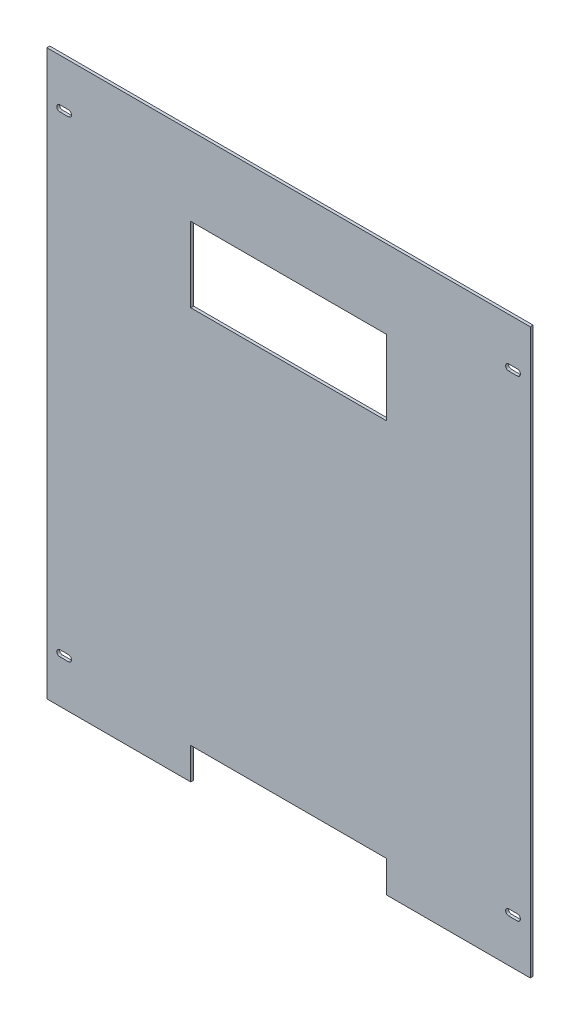
ISO-10303-21;
HEADER;
FILE_DESCRIPTION(('STEP AP214'),'2;1');
FILE_NAME('part.step','',(''),(''),'','','');
FILE_SCHEMA(('AUTOMOTIVE_DESIGN { 1 0 10303 214 1 1 1 1 }'));
ENDSEC;
DATA;
#1=APPLICATION_CONTEXT('core data for automotive mechanical design processes');
#2=APPLICATION_PROTOCOL_DEFINITION('international standard','automotive_design',2000,#1);
#3=PRODUCT_CONTEXT('',#1,'mechanical');
#4=PRODUCT('Part','Part','',(#3));
#5=PRODUCT_RELATED_PRODUCT_CATEGORY('part','',(#4));
#6=PRODUCT_DEFINITION_FORMATION('','',#4);
#7=PRODUCT_DEFINITION_CONTEXT('part definition',#1,'design');
#8=PRODUCT_DEFINITION('design','',#6,#7);
#9=PRODUCT_DEFINITION_SHAPE('','',#8);
#10=(LENGTH_UNIT() NAMED_UNIT(*) SI_UNIT(.MILLI.,.METRE.));
#11=(NAMED_UNIT(*) PLANE_ANGLE_UNIT() SI_UNIT($,.RADIAN.));
#12=(NAMED_UNIT(*) SI_UNIT($,.STERADIAN.) SOLID_ANGLE_UNIT());
#13=UNCERTAINTY_MEASURE_WITH_UNIT(LENGTH_MEASURE(1.E-05),#10,'distance_accuracy_value','');
#14=(GEOMETRIC_REPRESENTATION_CONTEXT(3) GLOBAL_UNCERTAINTY_ASSIGNED_CONTEXT((#13)) GLOBAL_UNIT_ASSIGNED_CONTEXT((#10,
#11,#12)) REPRESENTATION_CONTEXT('',''));
#15=CARTESIAN_POINT('',(0.,0.,0.));
#16=DIRECTION('',(0.,0.,1.));
#17=DIRECTION('',(1.,0.,0.));
#18=AXIS2_PLACEMENT_3D('',#15,#16,#17);
#19=CARTESIAN_POINT('',(0.,0.,3.175));
#20=DIRECTION('',(0.,1.,0.));
#21=DIRECTION('',(-1.,0.,0.));
#22=AXIS2_PLACEMENT_3D('',#19,#20,#21);
#23=PLANE('',#22);
#24=DIRECTION('',(1.,0.,0.));
#25=VECTOR('',#24,1.);
#26=CARTESIAN_POINT('',(0.,0.,3.175));
#27=LINE('',#26,#25);
#28=CARTESIAN_POINT('',(374.65,0.,3.175));
#29=VERTEX_POINT('',#28);
#30=CARTESIAN_POINT('',(533.4,0.,3.175));
#31=VERTEX_POINT('',#30);
#32=EDGE_CURVE('E246',#29,#31,#27,.T.);
#33=ORIENTED_EDGE('',*,*,#32,.F.);
#34=DIRECTION('',(0.,0.,-1.));
#35=VECTOR('',#34,1.);
#36=CARTESIAN_POINT('',(374.65,0.,3.175));
#37=LINE('',#36,#35);
#38=CARTESIAN_POINT('',(374.65,0.,0.));
#39=VERTEX_POINT('',#38);
#40=EDGE_CURVE('E646',#29,#39,#37,.T.);
#41=ORIENTED_EDGE('',*,*,#40,.T.);
#42=DIRECTION('',(1.,0.,0.));
#43=VECTOR('',#42,1.);
#44=CARTESIAN_POINT('',(0.,0.,0.));
#45=LINE('',#44,#43);
#46=CARTESIAN_POINT('',(533.4,0.,0.));
#47=VERTEX_POINT('',#46);
#48=EDGE_CURVE('E260',#39,#47,#45,.T.);
#49=ORIENTED_EDGE('',*,*,#48,.T.);
#50=DIRECTION('',(0.,0.,-1.));
#51=VECTOR('',#50,1.);
#52=CARTESIAN_POINT('',(533.4,0.,3.175));
#53=LINE('',#52,#51);
#54=EDGE_CURVE('E272',#31,#47,#53,.T.);
#55=ORIENTED_EDGE('',*,*,#54,.F.);
#56=EDGE_LOOP('',(#33,#41,#49,#55));
#57=FACE_BOUND('',#56,.T.);
#58=ADVANCED_FACE('F35',(#57),#23,.F.);
#59=CARTESIAN_POINT('',(509.5875,47.4218,0.));
#60=DIRECTION('',(0.,-1.,0.));
#61=DIRECTION('',(0.,0.,-1.));
#62=AXIS2_PLACEMENT_3D('',#59,#60,#61);
#63=PLANE('',#62);
#64=DIRECTION('',(1.,0.,0.));
#65=VECTOR('',#64,1.);
#66=CARTESIAN_POINT('',(509.5875,47.4218,3.175));
#67=LINE('',#66,#65);
#68=CARTESIAN_POINT('',(509.5875,47.4218,3.175));
#69=VERTEX_POINT('',#68);
#70=CARTESIAN_POINT('',(519.1125,47.4218,3.175));
#71=VERTEX_POINT('',#70);
#72=EDGE_CURVE('E315',#69,#71,#67,.T.);
#73=ORIENTED_EDGE('',*,*,#72,.T.);
#74=DIRECTION('',(0.,0.,1.));
#75=VECTOR('',#74,1.);
#76=CARTESIAN_POINT('',(519.1125,47.4218,0.));
#77=LINE('',#76,#75);
#78=CARTESIAN_POINT('',(519.1125,47.4218,0.));
#79=VERTEX_POINT('',#78);
#80=EDGE_CURVE('E11',#79,#71,#77,.T.);
#81=ORIENTED_EDGE('',*,*,#80,.F.);
#82=DIRECTION('',(1.,0.,0.));
#83=VECTOR('',#82,1.);
#84=CARTESIAN_POINT('',(509.5875,47.4218,0.));
#85=LINE('',#84,#83);
#86=CARTESIAN_POINT('',(509.5875,47.4218,0.));
#87=VERTEX_POINT('',#86);
#88=EDGE_CURVE('E320',#87,#79,#85,.T.);
#89=ORIENTED_EDGE('',*,*,#88,.F.);
#90=DIRECTION('',(0.,0.,1.));
#91=VECTOR('',#90,1.);
#92=CARTESIAN_POINT('',(509.5875,47.4218,0.));
#93=LINE('',#92,#91);
#94=EDGE_CURVE('E327',#87,#69,#93,.T.);
#95=ORIENTED_EDGE('',*,*,#94,.T.);
#96=EDGE_LOOP('',(#73,#81,#89,#95));
#97=FACE_BOUND('',#96,.T.);
#98=ADVANCED_FACE('F37',(#97),#63,.F.);
#99=CARTESIAN_POINT('',(519.1125,50.8000000000001,0.));
#100=DIRECTION('',(0.,0.,1.));
#101=DIRECTION('',(1.,0.,0.));
#102=AXIS2_PLACEMENT_3D('',#99,#100,#101);
#103=CYLINDRICAL_SURFACE('',#102,3.37820000000011);
#104=CARTESIAN_POINT('',(519.1125,50.8000000000001,3.175));
#105=DIRECTION('',(0.,0.,1.));
#106=DIRECTION('',(1.,0.,0.));
#107=AXIS2_PLACEMENT_3D('',#104,#105,#106);
#108=CIRCLE('',#107,3.37820000000011);
#109=CARTESIAN_POINT('',(519.1125,54.1782000000002,3.175));
#110=VERTEX_POINT('',#109);
#111=EDGE_CURVE('E312',#71,#110,#108,.T.);
#112=ORIENTED_EDGE('',*,*,#111,.T.);
#113=DIRECTION('',(0.,0.,1.));
#114=VECTOR('',#113,1.);
#115=CARTESIAN_POINT('',(519.1125,54.1782000000002,0.));
#116=LINE('',#115,#114);
#117=CARTESIAN_POINT('',(519.1125,54.1782000000002,0.));
#118=VERTEX_POINT('',#117);
#119=EDGE_CURVE('E43',#118,#110,#116,.T.);
#120=ORIENTED_EDGE('',*,*,#119,.F.);
#121=CARTESIAN_POINT('',(519.1125,50.8000000000001,0.));
#122=DIRECTION('',(0.,0.,1.));
#123=DIRECTION('',(1.,0.,0.));
#124=AXIS2_PLACEMENT_3D('',#121,#122,#123);
#125=CIRCLE('',#124,3.37820000000011);
#126=EDGE_CURVE('E322',#79,#118,#125,.T.);
#127=ORIENTED_EDGE('',*,*,#126,.F.);
#128=ORIENTED_EDGE('',*,*,#80,.T.);
#129=EDGE_LOOP('',(#112,#120,#127,#128));
#130=FACE_BOUND('',#129,.T.);
#131=ADVANCED_FACE('F340',(#130),#103,.F.);
#132=CARTESIAN_POINT('',(509.5875,54.1782000000002,0.));
#133=DIRECTION('',(0.,1.,0.));
#134=DIRECTION('',(0.,0.,1.));
#135=AXIS2_PLACEMENT_3D('',#132,#133,#134);
#136=PLANE('',#135);
#137=DIRECTION('',(-1.,0.,0.));
#138=VECTOR('',#137,1.);
#139=CARTESIAN_POINT('',(509.5875,54.1782000000002,3.175));
#140=LINE('',#139,#138);
#141=CARTESIAN_POINT('',(509.5875,54.1782000000002,3.175));
#142=VERTEX_POINT('',#141);
#143=EDGE_CURVE('E309',#110,#142,#140,.T.);
#144=ORIENTED_EDGE('',*,*,#143,.T.);
#145=DIRECTION('',(0.,0.,1.));
#146=VECTOR('',#145,1.);
#147=CARTESIAN_POINT('',(509.5875,54.1782000000002,0.));
#148=LINE('',#147,#146);
#149=CARTESIAN_POINT('',(509.5875,54.1782000000002,0.));
#150=VERTEX_POINT('',#149);
#151=EDGE_CURVE('E330',#150,#142,#148,.T.);
#152=ORIENTED_EDGE('',*,*,#151,.F.);
#153=DIRECTION('',(-1.,0.,0.));
#154=VECTOR('',#153,1.);
#155=CARTESIAN_POINT('',(509.5875,54.1782000000002,0.));
#156=LINE('',#155,#154);
#157=EDGE_CURVE('E324',#118,#150,#156,.T.);
#158=ORIENTED_EDGE('',*,*,#157,.F.);
#159=ORIENTED_EDGE('',*,*,#119,.T.);
#160=EDGE_LOOP('',(#144,#152,#158,#159));
#161=FACE_BOUND('',#160,.T.);
#162=ADVANCED_FACE('F336',(#161),#136,.F.);
#163=CARTESIAN_POINT('',(509.5875,50.8000000000001,0.));
#164=DIRECTION('',(0.,0.,1.));
#165=DIRECTION('',(1.,0.,0.));
#166=AXIS2_PLACEMENT_3D('',#163,#164,#165);
#167=CYLINDRICAL_SURFACE('',#166,3.37820000000011);
#168=CARTESIAN_POINT('',(509.5875,50.8000000000001,3.175));
#169=DIRECTION('',(0.,0.,1.));
#170=DIRECTION('',(1.,0.,0.));
#171=AXIS2_PLACEMENT_3D('',#168,#169,#170);
#172=CIRCLE('',#171,3.37820000000011);
#173=EDGE_CURVE('E307',#142,#69,#172,.T.);
#174=ORIENTED_EDGE('',*,*,#173,.T.);
#175=ORIENTED_EDGE('',*,*,#94,.F.);
#176=CARTESIAN_POINT('',(509.5875,50.8000000000001,0.));
#177=DIRECTION('',(0.,0.,1.));
#178=DIRECTION('',(1.,0.,0.));
#179=AXIS2_PLACEMENT_3D('',#176,#177,#178);
#180=CIRCLE('',#179,3.37820000000011);
#181=EDGE_CURVE('E318',#150,#87,#180,.T.);
#182=ORIENTED_EDGE('',*,*,#181,.F.);
#183=ORIENTED_EDGE('',*,*,#151,.T.);
#184=EDGE_LOOP('',(#174,#175,#182,#183));
#185=FACE_BOUND('',#184,.T.);
#186=ADVANCED_FACE('F348',(#185),#167,.F.);
#187=CARTESIAN_POINT('',(509.5875,568.1218,0.));
#188=DIRECTION('',(0.,-1.,0.));
#189=DIRECTION('',(0.,0.,-1.));
#190=AXIS2_PLACEMENT_3D('',#187,#188,#189);
#191=PLANE('',#190);
#192=DIRECTION('',(1.,0.,0.));
#193=VECTOR('',#192,1.);
#194=CARTESIAN_POINT('',(509.5875,568.1218,3.175));
#195=LINE('',#194,#193);
#196=CARTESIAN_POINT('',(509.5875,568.1218,3.175));
#197=VERTEX_POINT('',#196);
#198=CARTESIAN_POINT('',(519.1125,568.1218,3.175));
#199=VERTEX_POINT('',#198);
#200=EDGE_CURVE('E283',#197,#199,#195,.T.);
#201=ORIENTED_EDGE('',*,*,#200,.T.);
#202=DIRECTION('',(0.,0.,1.));
#203=VECTOR('',#202,1.);
#204=CARTESIAN_POINT('',(519.1125,568.1218,0.));
#205=LINE('',#204,#203);
#206=CARTESIAN_POINT('',(519.1125,568.1218,0.));
#207=VERTEX_POINT('',#206);
#208=EDGE_CURVE('E304',#207,#199,#205,.T.);
#209=ORIENTED_EDGE('',*,*,#208,.F.);
#210=DIRECTION('',(1.,0.,0.));
#211=VECTOR('',#210,1.);
#212=CARTESIAN_POINT('',(509.5875,568.1218,0.));
#213=LINE('',#212,#211);
#214=CARTESIAN_POINT('',(509.5875,568.1218,0.));
#215=VERTEX_POINT('',#214);
#216=EDGE_CURVE('E288',#215,#207,#213,.T.);
#217=ORIENTED_EDGE('',*,*,#216,.F.);
#218=DIRECTION('',(0.,0.,1.));
#219=VECTOR('',#218,1.);
#220=CARTESIAN_POINT('',(509.5875,568.1218,0.));
#221=LINE('',#220,#219);
#222=EDGE_CURVE('E295',#215,#197,#221,.T.);
#223=ORIENTED_EDGE('',*,*,#222,.T.);
#224=EDGE_LOOP('',(#201,#209,#217,#223));
#225=FACE_BOUND('',#224,.T.);
#226=ADVANCED_FACE('F396',(#225),#191,.F.);
#227=CARTESIAN_POINT('',(519.1125,571.5,0.));
#228=DIRECTION('',(0.,0.,1.));
#229=DIRECTION('',(1.,0.,0.));
#230=AXIS2_PLACEMENT_3D('',#227,#228,#229);
#231=CYLINDRICAL_SURFACE('',#230,3.37820000000011);
#232=CARTESIAN_POINT('',(519.1125,571.5,3.175));
#233=DIRECTION('',(0.,0.,1.));
#234=DIRECTION('',(1.,0.,0.));
#235=AXIS2_PLACEMENT_3D('',#232,#233,#234);
#236=CIRCLE('',#235,3.37820000000011);
#237=CARTESIAN_POINT('',(519.1125,574.8782,3.175));
#238=VERTEX_POINT('',#237);
#239=EDGE_CURVE('E280',#199,#238,#236,.T.);
#240=ORIENTED_EDGE('',*,*,#239,.T.);
#241=DIRECTION('',(0.,0.,1.));
#242=VECTOR('',#241,1.);
#243=CARTESIAN_POINT('',(519.1125,574.8782,0.));
#244=LINE('',#243,#242);
#245=CARTESIAN_POINT('',(519.1125,574.8782,0.));
#246=VERTEX_POINT('',#245);
#247=EDGE_CURVE('E301',#246,#238,#244,.T.);
#248=ORIENTED_EDGE('',*,*,#247,.F.);
#249=CARTESIAN_POINT('',(519.1125,571.5,0.));
#250=DIRECTION('',(0.,0.,1.));
#251=DIRECTION('',(1.,0.,0.));
#252=AXIS2_PLACEMENT_3D('',#249,#250,#251);
#253=CIRCLE('',#252,3.37820000000011);
#254=EDGE_CURVE('E290',#207,#246,#253,.T.);
#255=ORIENTED_EDGE('',*,*,#254,.F.);
#256=ORIENTED_EDGE('',*,*,#208,.T.);
#257=EDGE_LOOP('',(#240,#248,#255,#256));
#258=FACE_BOUND('',#257,.T.);
#259=ADVANCED_FACE('F390',(#258),#231,.F.);
#260=CARTESIAN_POINT('',(509.5875,574.8782,0.));
#261=DIRECTION('',(0.,1.,0.));
#262=DIRECTION('',(0.,0.,1.));
#263=AXIS2_PLACEMENT_3D('',#260,#261,#262);
#264=PLANE('',#263);
#265=DIRECTION('',(-1.,0.,0.));
#266=VECTOR('',#265,1.);
#267=CARTESIAN_POINT('',(509.5875,574.8782,3.175));
#268=LINE('',#267,#266);
#269=CARTESIAN_POINT('',(509.5875,574.8782,3.175));
#270=VERTEX_POINT('',#269);
#271=EDGE_CURVE('E277',#238,#270,#268,.T.);
#272=ORIENTED_EDGE('',*,*,#271,.T.);
#273=DIRECTION('',(0.,0.,1.));
#274=VECTOR('',#273,1.);
#275=CARTESIAN_POINT('',(509.5875,574.8782,0.));
#276=LINE('',#275,#274);
#277=CARTESIAN_POINT('',(509.5875,574.8782,0.));
#278=VERTEX_POINT('',#277);
#279=EDGE_CURVE('E298',#278,#270,#276,.T.);
#280=ORIENTED_EDGE('',*,*,#279,.F.);
#281=DIRECTION('',(-1.,0.,0.));
#282=VECTOR('',#281,1.);
#283=CARTESIAN_POINT('',(509.5875,574.8782,0.));
#284=LINE('',#283,#282);
#285=EDGE_CURVE('E292',#246,#278,#284,.T.);
#286=ORIENTED_EDGE('',*,*,#285,.F.);
#287=ORIENTED_EDGE('',*,*,#247,.T.);
#288=EDGE_LOOP('',(#272,#280,#286,#287));
#289=FACE_BOUND('',#288,.T.);
#290=ADVANCED_FACE('F385',(#289),#264,.F.);
#291=CARTESIAN_POINT('',(509.5875,571.5,0.));
#292=DIRECTION('',(0.,0.,1.));
#293=DIRECTION('',(1.,0.,0.));
#294=AXIS2_PLACEMENT_3D('',#291,#292,#293);
#295=CYLINDRICAL_SURFACE('',#294,3.37820000000011);
#296=CARTESIAN_POINT('',(509.5875,571.5,3.175));
#297=DIRECTION('',(0.,0.,1.));
#298=DIRECTION('',(1.,0.,0.));
#299=AXIS2_PLACEMENT_3D('',#296,#297,#298);
#300=CIRCLE('',#299,3.37820000000011);
#301=EDGE_CURVE('E275',#270,#197,#300,.T.);
#302=ORIENTED_EDGE('',*,*,#301,.T.);
#303=ORIENTED_EDGE('',*,*,#222,.F.);
#304=CARTESIAN_POINT('',(509.5875,571.5,0.));
#305=DIRECTION('',(0.,0.,1.));
#306=DIRECTION('',(1.,0.,0.));
#307=AXIS2_PLACEMENT_3D('',#304,#305,#306);
#308=CIRCLE('',#307,3.37820000000011);
#309=EDGE_CURVE('E286',#278,#215,#308,.T.);
#310=ORIENTED_EDGE('',*,*,#309,.F.);
#311=ORIENTED_EDGE('',*,*,#279,.T.);
#312=EDGE_LOOP('',(#302,#303,#310,#311));
#313=FACE_BOUND('',#312,.T.);
#314=ADVANCED_FACE('F378',(#313),#295,.F.);
#315=CARTESIAN_POINT('',(0.,0.,0.));
#316=VERTEX_POINT('',#315);
#317=CARTESIAN_POINT('',(158.75,0.,0.));
#318=VERTEX_POINT('',#317);
#319=EDGE_CURVE('E236',#316,#318,#45,.T.);
#320=ORIENTED_EDGE('',*,*,#319,.T.);
#321=DIRECTION('',(0.,0.,-1.));
#322=VECTOR('',#321,1.);
#323=CARTESIAN_POINT('',(158.75,0.,3.175));
#324=LINE('',#323,#322);
#325=CARTESIAN_POINT('',(158.75,0.,3.175));
#326=VERTEX_POINT('',#325);
#327=EDGE_CURVE('E50',#326,#318,#324,.T.);
#328=ORIENTED_EDGE('',*,*,#327,.F.);
#329=CARTESIAN_POINT('',(0.,0.,3.175));
#330=VERTEX_POINT('',#329);
#331=EDGE_CURVE('E234',#330,#326,#27,.T.);
#332=ORIENTED_EDGE('',*,*,#331,.F.);
#333=DIRECTION('',(0.,0.,-1.));
#334=VECTOR('',#333,1.);
#335=CARTESIAN_POINT('',(0.,0.,3.175));
#336=LINE('',#335,#334);
#337=EDGE_CURVE('E257',#330,#316,#336,.T.);
#338=ORIENTED_EDGE('',*,*,#337,.T.);
#339=EDGE_LOOP('',(#320,#328,#332,#338));
#340=FACE_BOUND('',#339,.T.);
#341=ADVANCED_FACE('F232',(#340),#23,.F.);
#342=CARTESIAN_POINT('',(533.4,0.,3.175));
#343=DIRECTION('',(-1.,0.,0.));
#344=DIRECTION('',(0.,0.,1.));
#345=AXIS2_PLACEMENT_3D('',#342,#343,#344);
#346=PLANE('',#345);
#347=DIRECTION('',(0.,1.,0.));
#348=VECTOR('',#347,1.);
#349=CARTESIAN_POINT('',(533.4,0.,0.));
#350=LINE('',#349,#348);
#351=CARTESIAN_POINT('',(533.4,622.3,0.));
#352=VERTEX_POINT('',#351);
#353=EDGE_CURVE('E259',#47,#352,#350,.T.);
#354=ORIENTED_EDGE('',*,*,#353,.T.);
#355=DIRECTION('',(0.,0.,-1.));
#356=VECTOR('',#355,1.);
#357=CARTESIAN_POINT('',(533.4,622.3,3.175));
#358=LINE('',#357,#356);
#359=CARTESIAN_POINT('',(533.4,622.3,3.175));
#360=VERTEX_POINT('',#359);
#361=EDGE_CURVE('E269',#360,#352,#358,.T.);
#362=ORIENTED_EDGE('',*,*,#361,.F.);
#363=DIRECTION('',(0.,1.,0.));
#364=VECTOR('',#363,1.);
#365=CARTESIAN_POINT('',(533.4,0.,3.175));
#366=LINE('',#365,#364);
#367=EDGE_CURVE('E245',#31,#360,#366,.T.);
#368=ORIENTED_EDGE('',*,*,#367,.F.);
#369=ORIENTED_EDGE('',*,*,#54,.T.);
#370=EDGE_LOOP('',(#354,#362,#368,#369));
#371=FACE_BOUND('',#370,.T.);
#372=ADVANCED_FACE('F377',(#371),#346,.F.);
#373=CARTESIAN_POINT('',(0.,622.3,3.175));
#374=DIRECTION('',(0.,-1.,0.));
#375=DIRECTION('',(0.,0.,-1.));
#376=AXIS2_PLACEMENT_3D('',#373,#374,#375);
#377=PLANE('',#376);
#378=DIRECTION('',(-1.,0.,0.));
#379=VECTOR('',#378,1.);
#380=CARTESIAN_POINT('',(0.,622.3,0.));
#381=LINE('',#380,#379);
#382=CARTESIAN_POINT('',(0.,622.3,0.));
#383=VERTEX_POINT('',#382);
#384=EDGE_CURVE('E262',#352,#383,#381,.T.);
#385=ORIENTED_EDGE('',*,*,#384,.T.);
#386=DIRECTION('',(0.,0.,-1.));
#387=VECTOR('',#386,1.);
#388=CARTESIAN_POINT('',(0.,622.3,3.175));
#389=LINE('',#388,#387);
#390=CARTESIAN_POINT('',(0.,622.3,3.175));
#391=VERTEX_POINT('',#390);
#392=EDGE_CURVE('E266',#391,#383,#389,.T.);
#393=ORIENTED_EDGE('',*,*,#392,.F.);
#394=DIRECTION('',(-1.,0.,0.));
#395=VECTOR('',#394,1.);
#396=CARTESIAN_POINT('',(0.,622.3,3.175));
#397=LINE('',#396,#395);
#398=EDGE_CURVE('E248',#360,#391,#397,.T.);
#399=ORIENTED_EDGE('',*,*,#398,.F.);
#400=ORIENTED_EDGE('',*,*,#361,.T.);
#401=EDGE_LOOP('',(#385,#393,#399,#400));
#402=FACE_BOUND('',#401,.T.);
#403=ADVANCED_FACE('F383',(#402),#377,.F.);
#404=CARTESIAN_POINT('',(0.,0.,3.175));
#405=DIRECTION('',(1.,0.,0.));
#406=DIRECTION('',(0.,0.,-1.));
#407=AXIS2_PLACEMENT_3D('',#404,#405,#406);
#408=PLANE('',#407);
#409=DIRECTION('',(0.,-1.,0.));
#410=VECTOR('',#409,1.);
#411=CARTESIAN_POINT('',(0.,0.,0.));
#412=LINE('',#411,#410);
#413=EDGE_CURVE('E250',#383,#316,#412,.T.);
#414=ORIENTED_EDGE('',*,*,#413,.T.);
#415=ORIENTED_EDGE('',*,*,#337,.F.);
#416=DIRECTION('',(0.,-1.,0.));
#417=VECTOR('',#416,1.);
#418=CARTESIAN_POINT('',(0.,0.,3.175));
#419=LINE('',#418,#417);
#420=EDGE_CURVE('E243',#391,#330,#419,.T.);
#421=ORIENTED_EDGE('',*,*,#420,.F.);
#422=ORIENTED_EDGE('',*,*,#392,.T.);
#423=EDGE_LOOP('',(#414,#415,#421,#422));
#424=FACE_BOUND('',#423,.T.);
#425=ADVANCED_FACE('F362',(#424),#408,.F.);
#426=CARTESIAN_POINT('',(0.,0.,3.175));
#427=DIRECTION('',(0.,0.,1.));
#428=DIRECTION('',(1.,0.,0.));
#429=AXIS2_PLACEMENT_3D('',#426,#427,#428);
#430=PLANE('',#429);
#431=DIRECTION('',(0.,-1.,0.));
#432=VECTOR('',#431,1.);
#433=CARTESIAN_POINT('',(374.65,0.,3.175));
#434=LINE('',#433,#432);
#435=CARTESIAN_POINT('',(374.65,34.925,3.175));
#436=VERTEX_POINT('',#435);
#437=EDGE_CURVE('E237',#436,#29,#434,.T.);
#438=ORIENTED_EDGE('',*,*,#437,.T.);
#439=ORIENTED_EDGE('',*,*,#32,.T.);
#440=ORIENTED_EDGE('',*,*,#367,.T.);
#441=ORIENTED_EDGE('',*,*,#398,.T.);
#442=ORIENTED_EDGE('',*,*,#420,.T.);
#443=ORIENTED_EDGE('',*,*,#331,.T.);
#444=DIRECTION('',(0.,1.,0.));
#445=VECTOR('',#444,1.);
#446=CARTESIAN_POINT('',(158.75,0.,3.175));
#447=LINE('',#446,#445);
#448=CARTESIAN_POINT('',(158.75,34.925,3.175));
#449=VERTEX_POINT('',#448);
#450=EDGE_CURVE('E219',#326,#449,#447,.T.);
#451=ORIENTED_EDGE('',*,*,#450,.T.);
#452=DIRECTION('',(1.,0.,0.));
#453=VECTOR('',#452,1.);
#454=CARTESIAN_POINT('',(374.65,34.925,3.175));
#455=LINE('',#454,#453);
#456=EDGE_CURVE('E226',#449,#436,#455,.T.);
#457=ORIENTED_EDGE('',*,*,#456,.T.);
#458=EDGE_LOOP('',(#438,#439,#440,#441,#442,#443,#451,#457));
#459=FACE_BOUND('',#458,.T.);
#460=DIRECTION('',(0.,-1.,0.));
#461=VECTOR('',#460,1.);
#462=CARTESIAN_POINT('',(374.65,535.697045058704,3.175));
#463=LINE('',#462,#461);
#464=CARTESIAN_POINT('',(374.65,535.697045058704,3.175));
#465=VERTEX_POINT('',#464);
#466=CARTESIAN_POINT('',(374.65,453.147045058705,3.175));
#467=VERTEX_POINT('',#466);
#468=EDGE_CURVE('E658',#465,#467,#463,.T.);
#469=ORIENTED_EDGE('',*,*,#468,.T.);
#470=DIRECTION('',(-1.,0.,0.));
#471=VECTOR('',#470,1.);
#472=CARTESIAN_POINT('',(374.65,453.147045058705,3.175));
#473=LINE('',#472,#471);
#474=CARTESIAN_POINT('',(158.75,453.147045058705,3.175));
#475=VERTEX_POINT('',#474);
#476=EDGE_CURVE('E661',#467,#475,#473,.T.);
#477=ORIENTED_EDGE('',*,*,#476,.T.);
#478=DIRECTION('',(0.,1.,0.));
#479=VECTOR('',#478,1.);
#480=CARTESIAN_POINT('',(158.75,535.697045058704,3.175));
#481=LINE('',#480,#479);
#482=CARTESIAN_POINT('',(158.75,535.697045058704,3.175));
#483=VERTEX_POINT('',#482);
#484=EDGE_CURVE('E58',#475,#483,#481,.T.);
#485=ORIENTED_EDGE('',*,*,#484,.T.);
#486=DIRECTION('',(1.,0.,0.));
#487=VECTOR('',#486,1.);
#488=CARTESIAN_POINT('',(374.65,535.697045058704,3.175));
#489=LINE('',#488,#487);
#490=EDGE_CURVE('E666',#483,#465,#489,.T.);
#491=ORIENTED_EDGE('',*,*,#490,.T.);
#492=EDGE_LOOP('',(#469,#477,#485,#491));
#493=FACE_BOUND('',#492,.T.);
#494=CARTESIAN_POINT('',(14.2875,50.8000000000001,3.175));
#495=DIRECTION('',(0.,0.,1.));
#496=DIRECTION('',(1.,0.,0.));
#497=AXIS2_PLACEMENT_3D('',#494,#495,#496);
#498=CIRCLE('',#497,3.37820000000011);
#499=CARTESIAN_POINT('',(14.2875,54.1782000000002,3.175));
#500=VERTEX_POINT('',#499);
#501=CARTESIAN_POINT('',(14.2875,47.4218,3.175));
#502=VERTEX_POINT('',#501);
#503=EDGE_CURVE('E619',#500,#502,#498,.T.);
#504=ORIENTED_EDGE('',*,*,#503,.F.);
#505=DIRECTION('',(-1.,0.,0.));
#506=VECTOR('',#505,1.);
#507=CARTESIAN_POINT('',(14.2875,54.1782000000002,3.175));
#508=LINE('',#507,#506);
#509=CARTESIAN_POINT('',(23.8125,54.1782000000002,3.175));
#510=VERTEX_POINT('',#509);
#511=EDGE_CURVE('E703',#510,#500,#508,.T.);
#512=ORIENTED_EDGE('',*,*,#511,.F.);
#513=CARTESIAN_POINT('',(23.8125,50.8000000000001,3.175));
#514=DIRECTION('',(0.,0.,1.));
#515=DIRECTION('',(1.,0.,0.));
#516=AXIS2_PLACEMENT_3D('',#513,#514,#515);
#517=CIRCLE('',#516,3.37820000000011);
#518=CARTESIAN_POINT('',(23.8125,47.4218,3.175));
#519=VERTEX_POINT('',#518);
#520=EDGE_CURVE('E695',#519,#510,#517,.T.);
#521=ORIENTED_EDGE('',*,*,#520,.F.);
#522=DIRECTION('',(1.,0.,0.));
#523=VECTOR('',#522,1.);
#524=CARTESIAN_POINT('',(14.2875,47.4218,3.175));
#525=LINE('',#524,#523);
#526=EDGE_CURVE('E679',#502,#519,#525,.T.);
#527=ORIENTED_EDGE('',*,*,#526,.F.);
#528=EDGE_LOOP('',(#504,#512,#521,#527));
#529=FACE_BOUND('',#528,.T.);
#530=CARTESIAN_POINT('',(14.2875,571.5,3.175));
#531=DIRECTION('',(0.,0.,1.));
#532=DIRECTION('',(1.,0.,0.));
#533=AXIS2_PLACEMENT_3D('',#530,#531,#532);
#534=CIRCLE('',#533,3.37820000000011);
#535=CARTESIAN_POINT('',(14.2875,574.8782,3.175));
#536=VERTEX_POINT('',#535);
#537=CARTESIAN_POINT('',(14.2875,568.1218,3.175));
#538=VERTEX_POINT('',#537);
#539=EDGE_CURVE('E591',#536,#538,#534,.T.);
#540=ORIENTED_EDGE('',*,*,#539,.F.);
#541=DIRECTION('',(-1.,0.,0.));
#542=VECTOR('',#541,1.);
#543=CARTESIAN_POINT('',(14.2875,574.8782,3.175));
#544=LINE('',#543,#542);
#545=CARTESIAN_POINT('',(23.8125,574.8782,3.175));
#546=VERTEX_POINT('',#545);
#547=EDGE_CURVE('E597',#546,#536,#544,.T.);
#548=ORIENTED_EDGE('',*,*,#547,.F.);
#549=CARTESIAN_POINT('',(23.8125,571.5,3.175));
#550=DIRECTION('',(0.,0.,1.));
#551=DIRECTION('',(1.,0.,0.));
#552=AXIS2_PLACEMENT_3D('',#549,#550,#551);
#553=CIRCLE('',#552,3.37820000000011);
#554=CARTESIAN_POINT('',(23.8125,568.1218,3.175));
#555=VERTEX_POINT('',#554);
#556=EDGE_CURVE('E590',#555,#546,#553,.T.);
#557=ORIENTED_EDGE('',*,*,#556,.F.);
#558=DIRECTION('',(1.,0.,0.));
#559=VECTOR('',#558,1.);
#560=CARTESIAN_POINT('',(14.2875,568.1218,3.175));
#561=LINE('',#560,#559);
#562=EDGE_CURVE('E583',#538,#555,#561,.T.);
#563=ORIENTED_EDGE('',*,*,#562,.F.);
#564=EDGE_LOOP('',(#540,#548,#557,#563));
#565=FACE_BOUND('',#564,.T.);
#566=ORIENTED_EDGE('',*,*,#301,.F.);
#567=ORIENTED_EDGE('',*,*,#271,.F.);
#568=ORIENTED_EDGE('',*,*,#239,.F.);
#569=ORIENTED_EDGE('',*,*,#200,.F.);
#570=EDGE_LOOP('',(#566,#567,#568,#569));
#571=FACE_BOUND('',#570,.T.);
#572=ORIENTED_EDGE('',*,*,#173,.F.);
#573=ORIENTED_EDGE('',*,*,#143,.F.);
#574=ORIENTED_EDGE('',*,*,#111,.F.);
#575=ORIENTED_EDGE('',*,*,#72,.F.);
#576=EDGE_LOOP('',(#572,#573,#574,#575));
#577=FACE_BOUND('',#576,.T.);
#578=ADVANCED_FACE('F240',(#459,#493,#529,#565,#571,#577),#430,.T.);
#579=CARTESIAN_POINT('',(0.,0.,0.));
#580=DIRECTION('',(0.,0.,1.));
#581=DIRECTION('',(1.,0.,0.));
#582=AXIS2_PLACEMENT_3D('',#579,#580,#581);
#583=PLANE('',#582);
#584=DIRECTION('',(-1.,0.,0.));
#585=VECTOR('',#584,1.);
#586=CARTESIAN_POINT('',(374.65,453.147045058705,0.));
#587=LINE('',#586,#585);
#588=CARTESIAN_POINT('',(374.65,453.147045058705,0.));
#589=VERTEX_POINT('',#588);
#590=CARTESIAN_POINT('',(158.75,453.147045058705,0.));
#591=VERTEX_POINT('',#590);
#592=EDGE_CURVE('E651',#589,#591,#587,.T.);
#593=ORIENTED_EDGE('',*,*,#592,.F.);
#594=DIRECTION('',(0.,-1.,0.));
#595=VECTOR('',#594,1.);
#596=CARTESIAN_POINT('',(374.65,535.697045058704,0.));
#597=LINE('',#596,#595);
#598=CARTESIAN_POINT('',(374.65,535.697045058704,0.));
#599=VERTEX_POINT('',#598);
#600=EDGE_CURVE('E648',#599,#589,#597,.T.);
#601=ORIENTED_EDGE('',*,*,#600,.F.);
#602=DIRECTION('',(1.,0.,0.));
#603=VECTOR('',#602,1.);
#604=CARTESIAN_POINT('',(374.65,535.697045058704,0.));
#605=LINE('',#604,#603);
#606=CARTESIAN_POINT('',(158.75,535.697045058704,0.));
#607=VERTEX_POINT('',#606);
#608=EDGE_CURVE('E662',#607,#599,#605,.T.);
#609=ORIENTED_EDGE('',*,*,#608,.F.);
#610=DIRECTION('',(0.,1.,0.));
#611=VECTOR('',#610,1.);
#612=CARTESIAN_POINT('',(158.75,535.697045058704,0.));
#613=LINE('',#612,#611);
#614=EDGE_CURVE('E672',#591,#607,#613,.T.);
#615=ORIENTED_EDGE('',*,*,#614,.F.);
#616=EDGE_LOOP('',(#593,#601,#609,#615));
#617=FACE_BOUND('',#616,.T.);
#618=DIRECTION('',(-1.,0.,0.));
#619=VECTOR('',#618,1.);
#620=CARTESIAN_POINT('',(14.2875,54.1782000000002,0.));
#621=LINE('',#620,#619);
#622=CARTESIAN_POINT('',(23.8125,54.1782000000002,0.));
#623=VERTEX_POINT('',#622);
#624=CARTESIAN_POINT('',(14.2875,54.1782000000002,0.));
#625=VERTEX_POINT('',#624);
#626=EDGE_CURVE('E624',#623,#625,#621,.T.);
#627=ORIENTED_EDGE('',*,*,#626,.T.);
#628=CARTESIAN_POINT('',(14.2875,50.8000000000001,0.));
#629=DIRECTION('',(0.,0.,1.));
#630=DIRECTION('',(1.,0.,0.));
#631=AXIS2_PLACEMENT_3D('',#628,#629,#630);
#632=CIRCLE('',#631,3.37820000000011);
#633=CARTESIAN_POINT('',(14.2875,47.4218,0.));
#634=VERTEX_POINT('',#633);
#635=EDGE_CURVE('E617',#625,#634,#632,.T.);
#636=ORIENTED_EDGE('',*,*,#635,.T.);
#637=DIRECTION('',(1.,0.,0.));
#638=VECTOR('',#637,1.);
#639=CARTESIAN_POINT('',(14.2875,47.4218,0.));
#640=LINE('',#639,#638);
#641=CARTESIAN_POINT('',(23.8125,47.4218,0.));
#642=VERTEX_POINT('',#641);
#643=EDGE_CURVE('E687',#634,#642,#640,.T.);
#644=ORIENTED_EDGE('',*,*,#643,.T.);
#645=CARTESIAN_POINT('',(23.8125,50.8000000000001,0.));
#646=DIRECTION('',(0.,0.,1.));
#647=DIRECTION('',(1.,0.,0.));
#648=AXIS2_PLACEMENT_3D('',#645,#646,#647);
#649=CIRCLE('',#648,3.37820000000011);
#650=EDGE_CURVE('E700',#642,#623,#649,.T.);
#651=ORIENTED_EDGE('',*,*,#650,.T.);
#652=EDGE_LOOP('',(#627,#636,#644,#651));
#653=FACE_BOUND('',#652,.T.);
#654=DIRECTION('',(-1.,0.,0.));
#655=VECTOR('',#654,1.);
#656=CARTESIAN_POINT('',(14.2875,574.8782,0.));
#657=LINE('',#656,#655);
#658=CARTESIAN_POINT('',(23.8125,574.8782,0.));
#659=VERTEX_POINT('',#658);
#660=CARTESIAN_POINT('',(14.2875,574.8782,0.));
#661=VERTEX_POINT('',#660);
#662=EDGE_CURVE('E606',#659,#661,#657,.T.);
#663=ORIENTED_EDGE('',*,*,#662,.T.);
#664=CARTESIAN_POINT('',(14.2875,571.5,0.));
#665=DIRECTION('',(0.,0.,1.));
#666=DIRECTION('',(1.,0.,0.));
#667=AXIS2_PLACEMENT_3D('',#664,#665,#666);
#668=CIRCLE('',#667,3.37820000000011);
#669=CARTESIAN_POINT('',(14.2875,568.1218,0.));
#670=VERTEX_POINT('',#669);
#671=EDGE_CURVE('E599',#661,#670,#668,.T.);
#672=ORIENTED_EDGE('',*,*,#671,.T.);
#673=DIRECTION('',(1.,0.,0.));
#674=VECTOR('',#673,1.);
#675=CARTESIAN_POINT('',(14.2875,568.1218,0.));
#676=LINE('',#675,#674);
#677=CARTESIAN_POINT('',(23.8125,568.1218,0.));
#678=VERTEX_POINT('',#677);
#679=EDGE_CURVE('E614',#670,#678,#676,.T.);
#680=ORIENTED_EDGE('',*,*,#679,.T.);
#681=CARTESIAN_POINT('',(23.8125,571.5,0.));
#682=DIRECTION('',(0.,0.,1.));
#683=DIRECTION('',(1.,0.,0.));
#684=AXIS2_PLACEMENT_3D('',#681,#682,#683);
#685=CIRCLE('',#684,3.37820000000011);
#686=EDGE_CURVE('E608',#678,#659,#685,.T.);
#687=ORIENTED_EDGE('',*,*,#686,.T.);
#688=EDGE_LOOP('',(#663,#672,#680,#687));
#689=FACE_BOUND('',#688,.T.);
#690=ORIENTED_EDGE('',*,*,#48,.F.);
#691=DIRECTION('',(0.,-1.,0.));
#692=VECTOR('',#691,1.);
#693=CARTESIAN_POINT('',(374.65,0.,0.));
#694=LINE('',#693,#692);
#695=CARTESIAN_POINT('',(374.65,34.925,0.));
#696=VERTEX_POINT('',#695);
#697=EDGE_CURVE('E227',#696,#39,#694,.T.);
#698=ORIENTED_EDGE('',*,*,#697,.F.);
#699=DIRECTION('',(1.,0.,0.));
#700=VECTOR('',#699,1.);
#701=CARTESIAN_POINT('',(374.65,34.925,0.));
#702=LINE('',#701,#700);
#703=CARTESIAN_POINT('',(158.75,34.925,0.));
#704=VERTEX_POINT('',#703);
#705=EDGE_CURVE('E722',#704,#696,#702,.T.);
#706=ORIENTED_EDGE('',*,*,#705,.F.);
#707=DIRECTION('',(0.,1.,0.));
#708=VECTOR('',#707,1.);
#709=CARTESIAN_POINT('',(158.75,0.,0.));
#710=LINE('',#709,#708);
#711=EDGE_CURVE('E723',#318,#704,#710,.T.);
#712=ORIENTED_EDGE('',*,*,#711,.F.);
#713=ORIENTED_EDGE('',*,*,#319,.F.);
#714=ORIENTED_EDGE('',*,*,#413,.F.);
#715=ORIENTED_EDGE('',*,*,#384,.F.);
#716=ORIENTED_EDGE('',*,*,#353,.F.);
#717=EDGE_LOOP('',(#690,#698,#706,#712,#713,#714,#715,#716));
#718=FACE_BOUND('',#717,.T.);
#719=ORIENTED_EDGE('',*,*,#309,.T.);
#720=ORIENTED_EDGE('',*,*,#216,.T.);
#721=ORIENTED_EDGE('',*,*,#254,.T.);
#722=ORIENTED_EDGE('',*,*,#285,.T.);
#723=EDGE_LOOP('',(#719,#720,#721,#722));
#724=FACE_BOUND('',#723,.T.);
#725=ORIENTED_EDGE('',*,*,#181,.T.);
#726=ORIENTED_EDGE('',*,*,#88,.T.);
#727=ORIENTED_EDGE('',*,*,#126,.T.);
#728=ORIENTED_EDGE('',*,*,#157,.T.);
#729=EDGE_LOOP('',(#725,#726,#727,#728));
#730=FACE_BOUND('',#729,.T.);
#731=ADVANCED_FACE('F350',(#617,#653,#689,#718,#724,#730),#583,.F.);
#732=CARTESIAN_POINT('',(14.2875,571.5,0.));
#733=DIRECTION('',(0.,0.,1.));
#734=DIRECTION('',(1.,0.,0.));
#735=AXIS2_PLACEMENT_3D('',#732,#733,#734);
#736=CYLINDRICAL_SURFACE('',#735,3.37820000000011);
#737=ORIENTED_EDGE('',*,*,#539,.T.);
#738=DIRECTION('',(0.,0.,1.));
#739=VECTOR('',#738,1.);
#740=CARTESIAN_POINT('',(14.2875,568.1218,0.));
#741=LINE('',#740,#739);
#742=EDGE_CURVE('E252',#670,#538,#741,.T.);
#743=ORIENTED_EDGE('',*,*,#742,.F.);
#744=ORIENTED_EDGE('',*,*,#671,.F.);
#745=DIRECTION('',(0.,0.,1.));
#746=VECTOR('',#745,1.);
#747=CARTESIAN_POINT('',(14.2875,574.8782,0.));
#748=LINE('',#747,#746);
#749=EDGE_CURVE('E603',#661,#536,#748,.T.);
#750=ORIENTED_EDGE('',*,*,#749,.T.);
#751=EDGE_LOOP('',(#737,#743,#744,#750));
#752=FACE_BOUND('',#751,.T.);
#753=ADVANCED_FACE('F352',(#752),#736,.F.);
#754=CARTESIAN_POINT('',(14.2875,574.8782,0.));
#755=DIRECTION('',(0.,1.,0.));
#756=DIRECTION('',(0.,0.,1.));
#757=AXIS2_PLACEMENT_3D('',#754,#755,#756);
#758=PLANE('',#757);
#759=ORIENTED_EDGE('',*,*,#547,.T.);
#760=ORIENTED_EDGE('',*,*,#749,.F.);
#761=ORIENTED_EDGE('',*,*,#662,.F.);
#762=DIRECTION('',(0.,0.,1.));
#763=VECTOR('',#762,1.);
#764=CARTESIAN_POINT('',(23.8125,574.8782,0.));
#765=LINE('',#764,#763);
#766=EDGE_CURVE('E605',#659,#546,#765,.T.);
#767=ORIENTED_EDGE('',*,*,#766,.T.);
#768=EDGE_LOOP('',(#759,#760,#761,#767));
#769=FACE_BOUND('',#768,.T.);
#770=ADVANCED_FACE('F359',(#769),#758,.F.);
#771=CARTESIAN_POINT('',(23.8125,571.5,0.));
#772=DIRECTION('',(0.,0.,1.));
#773=DIRECTION('',(1.,0.,0.));
#774=AXIS2_PLACEMENT_3D('',#771,#772,#773);
#775=CYLINDRICAL_SURFACE('',#774,3.37820000000011);
#776=ORIENTED_EDGE('',*,*,#556,.T.);
#777=ORIENTED_EDGE('',*,*,#766,.F.);
#778=ORIENTED_EDGE('',*,*,#686,.F.);
#779=DIRECTION('',(0.,0.,1.));
#780=VECTOR('',#779,1.);
#781=CARTESIAN_POINT('',(23.8125,568.1218,0.));
#782=LINE('',#781,#780);
#783=EDGE_CURVE('E586',#678,#555,#782,.T.);
#784=ORIENTED_EDGE('',*,*,#783,.T.);
#785=EDGE_LOOP('',(#776,#777,#778,#784));
#786=FACE_BOUND('',#785,.T.);
#787=ADVANCED_FACE('F571',(#786),#775,.F.);
#788=CARTESIAN_POINT('',(14.2875,568.1218,0.));
#789=DIRECTION('',(0.,-1.,0.));
#790=DIRECTION('',(0.,0.,-1.));
#791=AXIS2_PLACEMENT_3D('',#788,#789,#790);
#792=PLANE('',#791);
#793=ORIENTED_EDGE('',*,*,#562,.T.);
#794=ORIENTED_EDGE('',*,*,#783,.F.);
#795=ORIENTED_EDGE('',*,*,#679,.F.);
#796=ORIENTED_EDGE('',*,*,#742,.T.);
#797=EDGE_LOOP('',(#793,#794,#795,#796));
#798=FACE_BOUND('',#797,.T.);
#799=ADVANCED_FACE('F444',(#798),#792,.F.);
#800=CARTESIAN_POINT('',(14.2875,50.8000000000001,0.));
#801=DIRECTION('',(0.,0.,1.));
#802=DIRECTION('',(1.,0.,0.));
#803=AXIS2_PLACEMENT_3D('',#800,#801,#802);
#804=CYLINDRICAL_SURFACE('',#803,3.37820000000011);
#805=ORIENTED_EDGE('',*,*,#503,.T.);
#806=DIRECTION('',(0.,0.,1.));
#807=VECTOR('',#806,1.);
#808=CARTESIAN_POINT('',(14.2875,47.4218,0.));
#809=LINE('',#808,#807);
#810=EDGE_CURVE('E692',#634,#502,#809,.T.);
#811=ORIENTED_EDGE('',*,*,#810,.F.);
#812=ORIENTED_EDGE('',*,*,#635,.F.);
#813=DIRECTION('',(0.,0.,1.));
#814=VECTOR('',#813,1.);
#815=CARTESIAN_POINT('',(14.2875,54.1782000000002,0.));
#816=LINE('',#815,#814);
#817=EDGE_CURVE('E705',#625,#500,#816,.T.);
#818=ORIENTED_EDGE('',*,*,#817,.T.);
#819=EDGE_LOOP('',(#805,#811,#812,#818));
#820=FACE_BOUND('',#819,.T.);
#821=ADVANCED_FACE('F439',(#820),#804,.F.);
#822=CARTESIAN_POINT('',(14.2875,54.1782000000002,0.));
#823=DIRECTION('',(0.,1.,0.));
#824=DIRECTION('',(0.,0.,1.));
#825=AXIS2_PLACEMENT_3D('',#822,#823,#824);
#826=PLANE('',#825);
#827=ORIENTED_EDGE('',*,*,#511,.T.);
#828=ORIENTED_EDGE('',*,*,#817,.F.);
#829=ORIENTED_EDGE('',*,*,#626,.F.);
#830=DIRECTION('',(0.,0.,1.));
#831=VECTOR('',#830,1.);
#832=CARTESIAN_POINT('',(23.8125,54.1782000000002,0.));
#833=LINE('',#832,#831);
#834=EDGE_CURVE('E697',#623,#510,#833,.T.);
#835=ORIENTED_EDGE('',*,*,#834,.T.);
#836=EDGE_LOOP('',(#827,#828,#829,#835));
#837=FACE_BOUND('',#836,.T.);
#838=ADVANCED_FACE('F443',(#837),#826,.F.);
#839=CARTESIAN_POINT('',(23.8125,50.8000000000001,0.));
#840=DIRECTION('',(0.,0.,1.));
#841=DIRECTION('',(1.,0.,0.));
#842=AXIS2_PLACEMENT_3D('',#839,#840,#841);
#843=CYLINDRICAL_SURFACE('',#842,3.37820000000011);
#844=ORIENTED_EDGE('',*,*,#520,.T.);
#845=ORIENTED_EDGE('',*,*,#834,.F.);
#846=ORIENTED_EDGE('',*,*,#650,.F.);
#847=DIRECTION('',(0.,0.,1.));
#848=VECTOR('',#847,1.);
#849=CARTESIAN_POINT('',(23.8125,47.4218,0.));
#850=LINE('',#849,#848);
#851=EDGE_CURVE('E689',#642,#519,#850,.T.);
#852=ORIENTED_EDGE('',*,*,#851,.T.);
#853=EDGE_LOOP('',(#844,#845,#846,#852));
#854=FACE_BOUND('',#853,.T.);
#855=ADVANCED_FACE('F455',(#854),#843,.F.);
#856=CARTESIAN_POINT('',(14.2875,47.4218,0.));
#857=DIRECTION('',(0.,-1.,0.));
#858=DIRECTION('',(0.,0.,-1.));
#859=AXIS2_PLACEMENT_3D('',#856,#857,#858);
#860=PLANE('',#859);
#861=ORIENTED_EDGE('',*,*,#526,.T.);
#862=ORIENTED_EDGE('',*,*,#851,.F.);
#863=ORIENTED_EDGE('',*,*,#643,.F.);
#864=ORIENTED_EDGE('',*,*,#810,.T.);
#865=EDGE_LOOP('',(#861,#862,#863,#864));
#866=FACE_BOUND('',#865,.T.);
#867=ADVANCED_FACE('F465',(#866),#860,.F.);
#868=CARTESIAN_POINT('',(374.65,535.697045058704,3.175));
#869=DIRECTION('',(1.,0.,0.));
#870=DIRECTION('',(0.,1.,0.));
#871=AXIS2_PLACEMENT_3D('',#868,#869,#870);
#872=PLANE('',#871);
#873=ORIENTED_EDGE('',*,*,#600,.T.);
#874=DIRECTION('',(0.,0.,-1.));
#875=VECTOR('',#874,1.);
#876=CARTESIAN_POINT('',(374.65,453.147045058705,3.175));
#877=LINE('',#876,#875);
#878=EDGE_CURVE('E668',#467,#589,#877,.T.);
#879=ORIENTED_EDGE('',*,*,#878,.F.);
#880=ORIENTED_EDGE('',*,*,#468,.F.);
#881=DIRECTION('',(0.,0.,-1.));
#882=VECTOR('',#881,1.);
#883=CARTESIAN_POINT('',(374.65,535.697045058704,3.175));
#884=LINE('',#883,#882);
#885=EDGE_CURVE('E677',#465,#599,#884,.T.);
#886=ORIENTED_EDGE('',*,*,#885,.T.);
#887=EDGE_LOOP('',(#873,#879,#880,#886));
#888=FACE_BOUND('',#887,.T.);
#889=ADVANCED_FACE('F475',(#888),#872,.F.);
#890=CARTESIAN_POINT('',(374.65,535.697045058704,3.175));
#891=DIRECTION('',(0.,1.,0.));
#892=DIRECTION('',(0.,0.,1.));
#893=AXIS2_PLACEMENT_3D('',#890,#891,#892);
#894=PLANE('',#893);
#895=ORIENTED_EDGE('',*,*,#608,.T.);
#896=ORIENTED_EDGE('',*,*,#885,.F.);
#897=ORIENTED_EDGE('',*,*,#490,.F.);
#898=DIRECTION('',(0.,0.,-1.));
#899=VECTOR('',#898,1.);
#900=CARTESIAN_POINT('',(158.75,535.697045058704,3.175));
#901=LINE('',#900,#899);
#902=EDGE_CURVE('E680',#483,#607,#901,.T.);
#903=ORIENTED_EDGE('',*,*,#902,.T.);
#904=EDGE_LOOP('',(#895,#896,#897,#903));
#905=FACE_BOUND('',#904,.T.);
#906=ADVANCED_FACE('F485',(#905),#894,.F.);
#907=CARTESIAN_POINT('',(158.75,535.697045058704,3.175));
#908=DIRECTION('',(-1.,0.,0.));
#909=DIRECTION('',(0.,0.,1.));
#910=AXIS2_PLACEMENT_3D('',#907,#908,#909);
#911=PLANE('',#910);
#912=ORIENTED_EDGE('',*,*,#614,.T.);
#913=ORIENTED_EDGE('',*,*,#902,.F.);
#914=ORIENTED_EDGE('',*,*,#484,.F.);
#915=DIRECTION('',(0.,0.,-1.));
#916=VECTOR('',#915,1.);
#917=CARTESIAN_POINT('',(158.75,453.147045058705,3.175));
#918=LINE('',#917,#916);
#919=EDGE_CURVE('E682',#475,#591,#918,.T.);
#920=ORIENTED_EDGE('',*,*,#919,.T.);
#921=EDGE_LOOP('',(#912,#913,#914,#920));
#922=FACE_BOUND('',#921,.T.);
#923=ADVANCED_FACE('F495',(#922),#911,.F.);
#924=CARTESIAN_POINT('',(374.65,453.147045058705,3.175));
#925=DIRECTION('',(0.,-1.,0.));
#926=DIRECTION('',(0.,0.,-1.));
#927=AXIS2_PLACEMENT_3D('',#924,#925,#926);
#928=PLANE('',#927);
#929=ORIENTED_EDGE('',*,*,#592,.T.);
#930=ORIENTED_EDGE('',*,*,#919,.F.);
#931=ORIENTED_EDGE('',*,*,#476,.F.);
#932=ORIENTED_EDGE('',*,*,#878,.T.);
#933=EDGE_LOOP('',(#929,#930,#931,#932));
#934=FACE_BOUND('',#933,.T.);
#935=ADVANCED_FACE('F505',(#934),#928,.F.);
#936=CARTESIAN_POINT('',(374.65,0.,3.175));
#937=DIRECTION('',(1.,0.,0.));
#938=DIRECTION('',(0.,0.,-1.));
#939=AXIS2_PLACEMENT_3D('',#936,#937,#938);
#940=PLANE('',#939);
#941=ORIENTED_EDGE('',*,*,#697,.T.);
#942=ORIENTED_EDGE('',*,*,#40,.F.);
#943=ORIENTED_EDGE('',*,*,#437,.F.);
#944=DIRECTION('',(0.,0.,-1.));
#945=VECTOR('',#944,1.);
#946=CARTESIAN_POINT('',(374.65,34.925,3.175));
#947=LINE('',#946,#945);
#948=EDGE_CURVE('E649',#436,#696,#947,.T.);
#949=ORIENTED_EDGE('',*,*,#948,.T.);
#950=EDGE_LOOP('',(#941,#942,#943,#949));
#951=FACE_BOUND('',#950,.T.);
#952=ADVANCED_FACE('F513',(#951),#940,.F.);
#953=CARTESIAN_POINT('',(374.65,34.925,3.175));
#954=DIRECTION('',(0.,1.,0.));
#955=DIRECTION('',(0.,0.,1.));
#956=AXIS2_PLACEMENT_3D('',#953,#954,#955);
#957=PLANE('',#956);
#958=ORIENTED_EDGE('',*,*,#705,.T.);
#959=ORIENTED_EDGE('',*,*,#948,.F.);
#960=ORIENTED_EDGE('',*,*,#456,.F.);
#961=DIRECTION('',(0.,0.,-1.));
#962=VECTOR('',#961,1.);
#963=CARTESIAN_POINT('',(158.75,34.925,3.175));
#964=LINE('',#963,#962);
#965=EDGE_CURVE('E221',#449,#704,#964,.T.);
#966=ORIENTED_EDGE('',*,*,#965,.T.);
#967=EDGE_LOOP('',(#958,#959,#960,#966));
#968=FACE_BOUND('',#967,.T.);
#969=ADVANCED_FACE('F546',(#968),#957,.F.);
#970=CARTESIAN_POINT('',(158.75,0.,3.175));
#971=DIRECTION('',(-1.,0.,0.));
#972=DIRECTION('',(0.,-1.,0.));
#973=AXIS2_PLACEMENT_3D('',#970,#971,#972);
#974=PLANE('',#973);
#975=ORIENTED_EDGE('',*,*,#711,.T.);
#976=ORIENTED_EDGE('',*,*,#965,.F.);
#977=ORIENTED_EDGE('',*,*,#450,.F.);
#978=ORIENTED_EDGE('',*,*,#327,.T.);
#979=EDGE_LOOP('',(#975,#976,#977,#978));
#980=FACE_BOUND('',#979,.T.);
#981=ADVANCED_FACE('F220',(#980),#974,.F.);
#982=CLOSED_SHELL('',(#58,#98,#131,#162,#186,#226,#259,#290,#314,#341,#372,#403,#425,#578,#731,
#753,#770,#787,#799,#821,#838,#855,#867,#889,#906,#923,#935,#952,#969,#981));
#983=MANIFOLD_SOLID_BREP('B2',#982);
#984=ADVANCED_BREP_SHAPE_REPRESENTATION('',(#18,#983),#14);
#985=SHAPE_DEFINITION_REPRESENTATION(#9,#984);
ENDSEC;
END-ISO-10303-21;
